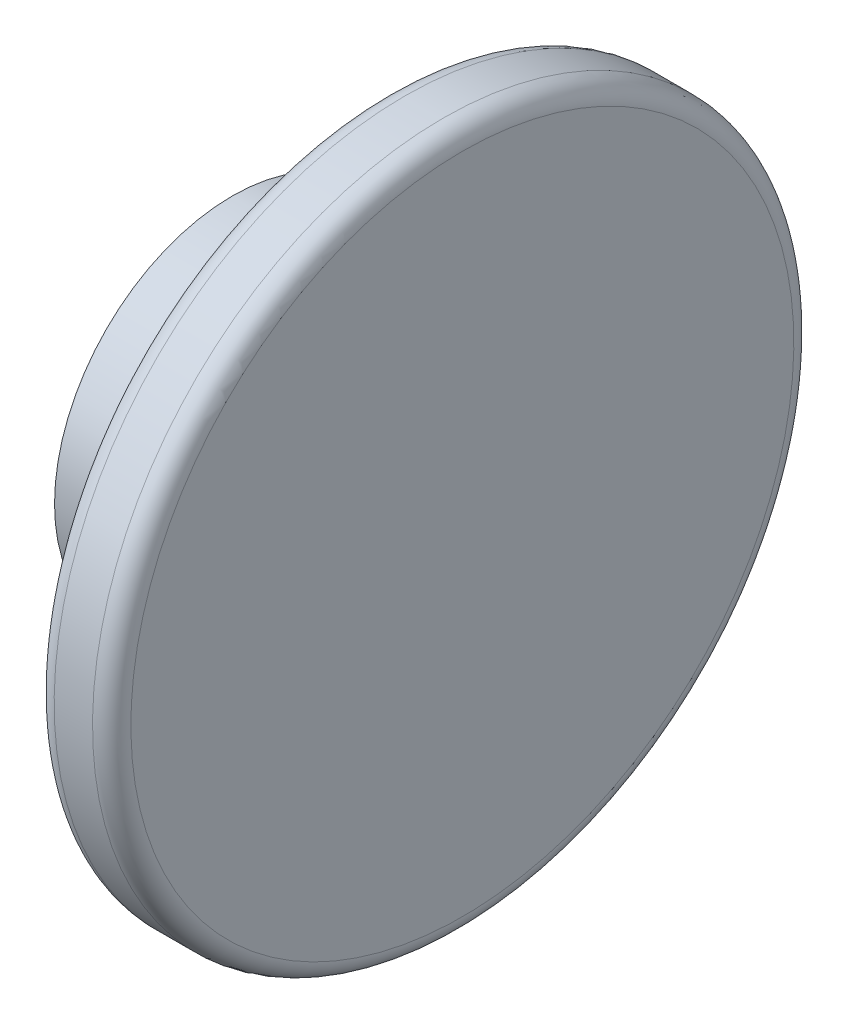
ISO-10303-21;
HEADER;
FILE_DESCRIPTION(('STEP AP214'),'2;1');
FILE_NAME('part.step','',(''),(''),'','','');
FILE_SCHEMA(('AUTOMOTIVE_DESIGN { 1 0 10303 214 1 1 1 1 }'));
ENDSEC;
DATA;
#1=APPLICATION_CONTEXT('core data for automotive mechanical design processes');
#2=APPLICATION_PROTOCOL_DEFINITION('international standard','automotive_design',2000,#1);
#3=PRODUCT_CONTEXT('',#1,'mechanical');
#4=PRODUCT('Part','Part','',(#3));
#5=PRODUCT_RELATED_PRODUCT_CATEGORY('part','',(#4));
#6=PRODUCT_DEFINITION_FORMATION('','',#4);
#7=PRODUCT_DEFINITION_CONTEXT('part definition',#1,'design');
#8=PRODUCT_DEFINITION('design','',#6,#7);
#9=PRODUCT_DEFINITION_SHAPE('','',#8);
#10=(LENGTH_UNIT() NAMED_UNIT(*) SI_UNIT(.MILLI.,.METRE.));
#11=(NAMED_UNIT(*) PLANE_ANGLE_UNIT() SI_UNIT($,.RADIAN.));
#12=(NAMED_UNIT(*) SI_UNIT($,.STERADIAN.) SOLID_ANGLE_UNIT());
#13=UNCERTAINTY_MEASURE_WITH_UNIT(LENGTH_MEASURE(1.E-05),#10,'distance_accuracy_value','');
#14=(GEOMETRIC_REPRESENTATION_CONTEXT(3) GLOBAL_UNCERTAINTY_ASSIGNED_CONTEXT((#13)) GLOBAL_UNIT_ASSIGNED_CONTEXT((#10,
#11,#12)) REPRESENTATION_CONTEXT('',''));
#15=CARTESIAN_POINT('',(0.,0.,0.));
#16=DIRECTION('',(0.,0.,1.));
#17=DIRECTION('',(1.,0.,0.));
#18=AXIS2_PLACEMENT_3D('',#15,#16,#17);
#19=CARTESIAN_POINT('',(8.255,0.,0.));
#20=DIRECTION('',(-1.,0.,0.));
#21=DIRECTION('',(0.,-1.,0.));
#22=AXIS2_PLACEMENT_3D('',#19,#20,#21);
#23=CYLINDRICAL_SURFACE('',#22,18.542);
#24=CARTESIAN_POINT('',(24.25,0.,0.));
#25=DIRECTION('',(1.,0.,0.));
#26=DIRECTION('',(0.,1.,0.));
#27=AXIS2_PLACEMENT_3D('',#24,#25,#26);
#28=CIRCLE('',#27,18.542);
#29=CARTESIAN_POINT('',(24.25,18.542,0.));
#30=VERTEX_POINT('',#29);
#31=EDGE_CURVE('E67',#30,#30,#28,.F.);
#32=ORIENTED_EDGE('',*,*,#31,.T.);
#33=EDGE_LOOP('',(#32));
#34=FACE_BOUND('',#33,.T.);
#35=CARTESIAN_POINT('',(10.255,0.,0.));
#36=DIRECTION('',(-1.,0.,0.));
#37=DIRECTION('',(0.,-1.,0.));
#38=AXIS2_PLACEMENT_3D('',#35,#36,#37);
#39=CIRCLE('',#38,18.542);
#40=CARTESIAN_POINT('',(10.255,-18.542,0.));
#41=VERTEX_POINT('',#40);
#42=EDGE_CURVE('E76',#41,#41,#39,.T.);
#43=ORIENTED_EDGE('',*,*,#42,.F.);
#44=EDGE_LOOP('',(#43));
#45=FACE_BOUND('',#44,.T.);
#46=ADVANCED_FACE('F38',(#34,#45),#23,.T.);
#47=CARTESIAN_POINT('',(34.25,0.,0.));
#48=DIRECTION('',(-1.,0.,0.));
#49=DIRECTION('',(0.,-1.,0.));
#50=AXIS2_PLACEMENT_3D('',#47,#48,#49);
#51=CYLINDRICAL_SURFACE('',#50,36.576);
#52=CARTESIAN_POINT('',(28.25,0.,0.));
#53=DIRECTION('',(1.,0.,0.));
#54=DIRECTION('',(0.,1.,0.));
#55=AXIS2_PLACEMENT_3D('',#52,#53,#54);
#56=CIRCLE('',#55,36.576);
#57=CARTESIAN_POINT('',(28.25,36.576,0.));
#58=VERTEX_POINT('',#57);
#59=EDGE_CURVE('E53',#58,#58,#56,.T.);
#60=ORIENTED_EDGE('',*,*,#59,.T.);
#61=EDGE_LOOP('',(#60));
#62=FACE_BOUND('',#61,.T.);
#63=CARTESIAN_POINT('',(32.25,0.,0.));
#64=DIRECTION('',(1.,0.,0.));
#65=DIRECTION('',(0.,1.,0.));
#66=AXIS2_PLACEMENT_3D('',#63,#64,#65);
#67=CIRCLE('',#66,36.576);
#68=CARTESIAN_POINT('',(32.25,36.576,0.));
#69=VERTEX_POINT('',#68);
#70=EDGE_CURVE('E58',#69,#69,#67,.F.);
#71=ORIENTED_EDGE('',*,*,#70,.T.);
#72=EDGE_LOOP('',(#71));
#73=FACE_BOUND('',#72,.T.);
#74=ADVANCED_FACE('F83',(#62,#73),#51,.T.);
#75=CARTESIAN_POINT('',(34.25,0.,0.));
#76=DIRECTION('',(1.,0.,0.));
#77=DIRECTION('',(0.,1.,0.));
#78=AXIS2_PLACEMENT_3D('',#75,#76,#77);
#79=PLANE('',#78);
#80=CARTESIAN_POINT('',(34.25,0.,0.));
#81=DIRECTION('',(1.,0.,0.));
#82=DIRECTION('',(0.,1.,0.));
#83=AXIS2_PLACEMENT_3D('',#80,#81,#82);
#84=CIRCLE('',#83,34.576);
#85=CARTESIAN_POINT('',(34.25,34.576,0.));
#86=VERTEX_POINT('',#85);
#87=EDGE_CURVE('E49',#86,#86,#84,.T.);
#88=ORIENTED_EDGE('',*,*,#87,.T.);
#89=EDGE_LOOP('',(#88));
#90=FACE_BOUND('',#89,.T.);
#91=ADVANCED_FACE('F89',(#90),#79,.T.);
#92=CARTESIAN_POINT('',(26.25,0.,0.));
#93=DIRECTION('',(1.,0.,0.));
#94=DIRECTION('',(0.,1.,0.));
#95=AXIS2_PLACEMENT_3D('',#92,#93,#94);
#96=PLANE('',#95);
#97=CARTESIAN_POINT('',(26.25,0.,0.));
#98=DIRECTION('',(1.,0.,0.));
#99=DIRECTION('',(0.,1.,0.));
#100=AXIS2_PLACEMENT_3D('',#97,#98,#99);
#101=CIRCLE('',#100,20.542);
#102=CARTESIAN_POINT('',(26.25,20.542,0.));
#103=VERTEX_POINT('',#102);
#104=EDGE_CURVE('E61',#103,#103,#101,.T.);
#105=ORIENTED_EDGE('',*,*,#104,.T.);
#106=EDGE_LOOP('',(#105));
#107=FACE_BOUND('',#106,.T.);
#108=CARTESIAN_POINT('',(26.25,0.,0.));
#109=DIRECTION('',(1.,0.,0.));
#110=DIRECTION('',(0.,1.,0.));
#111=AXIS2_PLACEMENT_3D('',#108,#109,#110);
#112=CIRCLE('',#111,34.576);
#113=CARTESIAN_POINT('',(26.25,34.576,0.));
#114=VERTEX_POINT('',#113);
#115=EDGE_CURVE('E64',#114,#114,#112,.F.);
#116=ORIENTED_EDGE('',*,*,#115,.T.);
#117=EDGE_LOOP('',(#116));
#118=FACE_BOUND('',#117,.T.);
#119=ADVANCED_FACE('F103',(#107,#118),#96,.F.);
#120=CARTESIAN_POINT('',(24.25,0.,0.));
#121=DIRECTION('',(1.,0.,0.));
#122=DIRECTION('',(0.,1.,0.));
#123=AXIS2_PLACEMENT_3D('',#120,#121,#122);
#124=TOROIDAL_SURFACE('',#123,20.542,2.);
#125=ORIENTED_EDGE('',*,*,#104,.F.);
#126=EDGE_LOOP('',(#125));
#127=FACE_BOUND('',#126,.T.);
#128=ORIENTED_EDGE('',*,*,#31,.F.);
#129=EDGE_LOOP('',(#128));
#130=FACE_BOUND('',#129,.T.);
#131=ADVANCED_FACE('F99',(#127,#130),#124,.F.);
#132=CARTESIAN_POINT('',(28.25,0.,0.));
#133=DIRECTION('',(1.,0.,0.));
#134=DIRECTION('',(0.,1.,0.));
#135=AXIS2_PLACEMENT_3D('',#132,#133,#134);
#136=TOROIDAL_SURFACE('',#135,34.576,2.);
#137=ORIENTED_EDGE('',*,*,#115,.F.);
#138=EDGE_LOOP('',(#137));
#139=FACE_BOUND('',#138,.T.);
#140=ORIENTED_EDGE('',*,*,#59,.F.);
#141=EDGE_LOOP('',(#140));
#142=FACE_BOUND('',#141,.T.);
#143=ADVANCED_FACE('F102',(#139,#142),#136,.T.);
#144=CARTESIAN_POINT('',(32.25,0.,0.));
#145=DIRECTION('',(1.,0.,0.));
#146=DIRECTION('',(0.,1.,0.));
#147=AXIS2_PLACEMENT_3D('',#144,#145,#146);
#148=TOROIDAL_SURFACE('',#147,34.576,2.);
#149=ORIENTED_EDGE('',*,*,#70,.F.);
#150=EDGE_LOOP('',(#149));
#151=FACE_BOUND('',#150,.T.);
#152=ORIENTED_EDGE('',*,*,#87,.F.);
#153=EDGE_LOOP('',(#152));
#154=FACE_BOUND('',#153,.T.);
#155=ADVANCED_FACE('F106',(#151,#154),#148,.T.);
#156=CARTESIAN_POINT('',(8.25500000000001,0.,0.));
#157=DIRECTION('',(1.,0.,0.));
#158=DIRECTION('',(0.,0.,-1.));
#159=AXIS2_PLACEMENT_3D('',#156,#157,#158);
#160=CONICAL_SURFACE('',#159,12.7,1.24095417393009);
#161=CARTESIAN_POINT('',(8.52453259496889,0.,0.));
#162=DIRECTION('',(1.,0.,0.));
#163=DIRECTION('',(0.,0.,-1.));
#164=AXIS2_PLACEMENT_3D('',#161,#162,#163);
#165=CIRCLE('',#164,13.4873047099041);
#166=CARTESIAN_POINT('',(8.52453259496889,0.,-13.4873047099041));
#167=VERTEX_POINT('',#166);
#168=EDGE_CURVE('E10',#167,#167,#165,.T.);
#169=ORIENTED_EDGE('',*,*,#168,.T.);
#170=EDGE_LOOP('',(#169));
#171=FACE_BOUND('',#170,.T.);
#172=ORIENTED_EDGE('',*,*,#42,.T.);
#173=EDGE_LOOP('',(#172));
#174=FACE_BOUND('',#173,.T.);
#175=ADVANCED_FACE('F80',(#171,#174),#160,.T.);
#176=CARTESIAN_POINT('',(16.8275,0.,0.));
#177=DIRECTION('',(-1.,0.,0.));
#178=DIRECTION('',(0.,-1.,0.));
#179=AXIS2_PLACEMENT_3D('',#176,#177,#178);
#180=PLANE('',#179);
#181=CARTESIAN_POINT('',(16.8275,0.,0.));
#182=DIRECTION('',(-1.,0.,0.));
#183=DIRECTION('',(0.,-1.,0.));
#184=AXIS2_PLACEMENT_3D('',#181,#182,#183);
#185=CIRCLE('',#184,3.26548431209613);
#186=CARTESIAN_POINT('',(16.8275,-3.26548431209612,0.));
#187=VERTEX_POINT('',#186);
#188=EDGE_CURVE('E70',#187,#187,#185,.T.);
#189=ORIENTED_EDGE('',*,*,#188,.T.);
#190=EDGE_LOOP('',(#189));
#191=FACE_BOUND('',#190,.T.);
#192=ADVANCED_FACE('F113',(#191),#180,.T.);
#193=CARTESIAN_POINT('',(8.25500000000001,0.,0.));
#194=DIRECTION('',(-1.,0.,0.));
#195=DIRECTION('',(0.,-1.,0.));
#196=AXIS2_PLACEMENT_3D('',#193,#194,#195);
#197=CONICAL_SURFACE('',#196,3.71475,0.05235987755983);
#198=ORIENTED_EDGE('',*,*,#188,.F.);
#199=EDGE_LOOP('',(#198));
#200=FACE_BOUND('',#199,.T.);
#201=CARTESIAN_POINT('',(8.25500000000001,0.,0.));
#202=DIRECTION('',(-1.,0.,0.));
#203=DIRECTION('',(0.,-1.,0.));
#204=AXIS2_PLACEMENT_3D('',#201,#202,#203);
#205=CIRCLE('',#204,3.71475);
#206=CARTESIAN_POINT('',(8.25500000000001,-3.71474999999999,0.));
#207=VERTEX_POINT('',#206);
#208=EDGE_CURVE('E73',#207,#207,#205,.T.);
#209=ORIENTED_EDGE('',*,*,#208,.T.);
#210=EDGE_LOOP('',(#209));
#211=FACE_BOUND('',#210,.T.);
#212=ADVANCED_FACE('F94',(#200,#211),#197,.F.);
#213=CARTESIAN_POINT('',(8.25500000000001,0.,0.));
#214=DIRECTION('',(1.,0.,0.));
#215=DIRECTION('',(0.,1.,0.));
#216=AXIS2_PLACEMENT_3D('',#213,#214,#215);
#217=PLANE('',#216);
#218=CARTESIAN_POINT('',(8.25500000000001,0.,0.));
#219=DIRECTION('',(1.,0.,0.));
#220=DIRECTION('',(0.,1.,0.));
#221=AXIS2_PLACEMENT_3D('',#218,#219,#220);
#222=CIRCLE('',#221,11.8678362384796);
#223=CARTESIAN_POINT('',(8.255,11.8678362384796,0.));
#224=VERTEX_POINT('',#223);
#225=EDGE_CURVE('E45',#224,#224,#222,.F.);
#226=ORIENTED_EDGE('',*,*,#225,.T.);
#227=EDGE_LOOP('',(#226));
#228=FACE_BOUND('',#227,.T.);
#229=ORIENTED_EDGE('',*,*,#208,.F.);
#230=EDGE_LOOP('',(#229));
#231=FACE_BOUND('',#230,.T.);
#232=ADVANCED_FACE('F96',(#228,#231),#217,.F.);
#233=CARTESIAN_POINT('',(13.255,0.,0.));
#234=DIRECTION('',(1.,0.,0.));
#235=DIRECTION('',(0.,1.,0.));
#236=AXIS2_PLACEMENT_3D('',#233,#234,#235);
#237=TOROIDAL_SURFACE('',#236,11.8678362384796,5.);
#238=ORIENTED_EDGE('',*,*,#168,.F.);
#239=EDGE_LOOP('',(#238));
#240=FACE_BOUND('',#239,.T.);
#241=ORIENTED_EDGE('',*,*,#225,.F.);
#242=EDGE_LOOP('',(#241));
#243=FACE_BOUND('',#242,.T.);
#244=ADVANCED_FACE('F40',(#240,#243),#237,.T.);
#245=CLOSED_SHELL('',(#46,#74,#91,#119,#131,#143,#155,#175,#192,#212,#232,#244));
#246=MANIFOLD_SOLID_BREP('B2',#245);
#247=ADVANCED_BREP_SHAPE_REPRESENTATION('',(#18,#246),#14);
#248=SHAPE_DEFINITION_REPRESENTATION(#9,#247);
ENDSEC;
END-ISO-10303-21;
